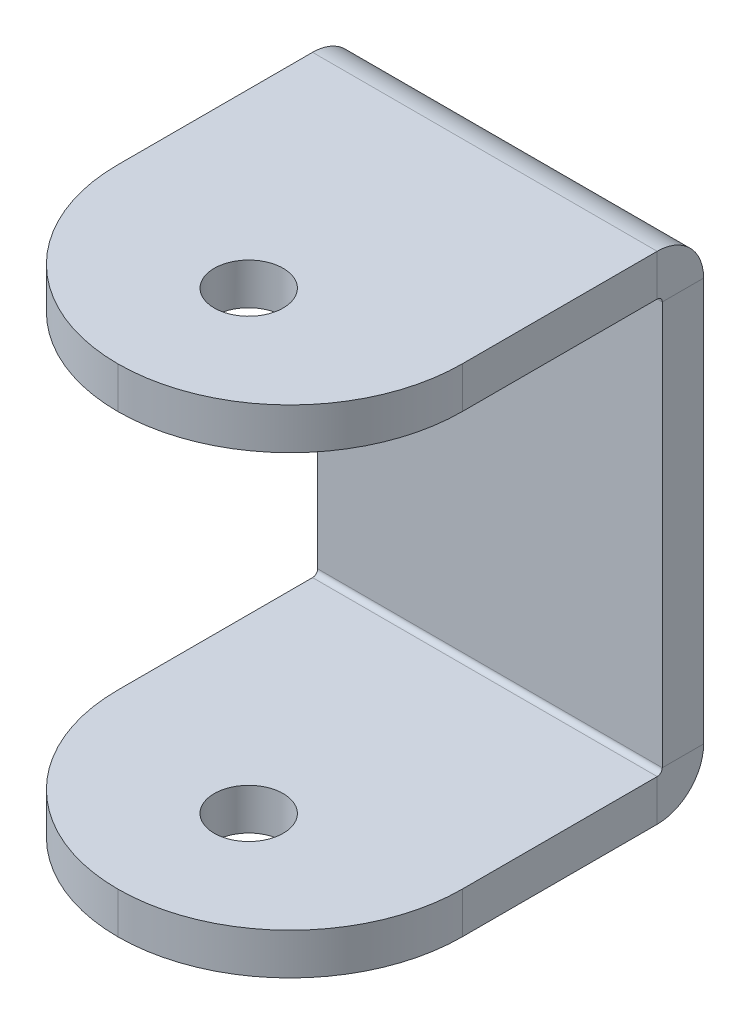
ISO-10303-21;
HEADER;
FILE_DESCRIPTION(('STEP AP214'),'2;1');
FILE_NAME('part.step','',(''),(''),'','','');
FILE_SCHEMA(('AUTOMOTIVE_DESIGN { 1 0 10303 214 1 1 1 1 }'));
ENDSEC;
DATA;
#1=APPLICATION_CONTEXT('core data for automotive mechanical design processes');
#2=APPLICATION_PROTOCOL_DEFINITION('international standard','automotive_design',2000,#1);
#3=PRODUCT_CONTEXT('',#1,'mechanical');
#4=PRODUCT('Part','Part','',(#3));
#5=PRODUCT_RELATED_PRODUCT_CATEGORY('part','',(#4));
#6=PRODUCT_DEFINITION_FORMATION('','',#4);
#7=PRODUCT_DEFINITION_CONTEXT('part definition',#1,'design');
#8=PRODUCT_DEFINITION('design','',#6,#7);
#9=PRODUCT_DEFINITION_SHAPE('','',#8);
#10=(LENGTH_UNIT() NAMED_UNIT(*) SI_UNIT(.MILLI.,.METRE.));
#11=(NAMED_UNIT(*) PLANE_ANGLE_UNIT() SI_UNIT($,.RADIAN.));
#12=(NAMED_UNIT(*) SI_UNIT($,.STERADIAN.) SOLID_ANGLE_UNIT());
#13=UNCERTAINTY_MEASURE_WITH_UNIT(LENGTH_MEASURE(1.E-05),#10,'distance_accuracy_value','');
#14=(GEOMETRIC_REPRESENTATION_CONTEXT(3) GLOBAL_UNCERTAINTY_ASSIGNED_CONTEXT((#13)) GLOBAL_UNIT_ASSIGNED_CONTEXT((#10,
#11,#12)) REPRESENTATION_CONTEXT('',''));
#15=CARTESIAN_POINT('',(0.,0.,0.));
#16=DIRECTION('',(0.,0.,1.));
#17=DIRECTION('',(1.,0.,0.));
#18=AXIS2_PLACEMENT_3D('',#15,#16,#17);
#19=CARTESIAN_POINT('',(-25.,-30.,-6.));
#20=DIRECTION('',(0.,0.,1.));
#21=DIRECTION('',(1.,0.,0.));
#22=AXIS2_PLACEMENT_3D('',#19,#20,#21);
#23=PLANE('',#22);
#24=DIRECTION('',(1.,0.,0.));
#25=VECTOR('',#24,1.);
#26=CARTESIAN_POINT('',(25.,-29.2634,-6.));
#27=LINE('',#26,#25);
#28=CARTESIAN_POINT('',(25.,-29.2634,-6.));
#29=VERTEX_POINT('',#28);
#30=CARTESIAN_POINT('',(-25.,-29.2634,-6.));
#31=VERTEX_POINT('',#30);
#32=EDGE_CURVE('E143',#29,#31,#27,.F.);
#33=ORIENTED_EDGE('',*,*,#32,.T.);
#34=DIRECTION('',(0.,-1.,0.));
#35=VECTOR('',#34,1.);
#36=CARTESIAN_POINT('',(-25.,30.,-6.));
#37=LINE('',#36,#35);
#38=CARTESIAN_POINT('',(-25.,29.2634,-5.99999999999999));
#39=VERTEX_POINT('',#38);
#40=EDGE_CURVE('E237',#39,#31,#37,.T.);
#41=ORIENTED_EDGE('',*,*,#40,.F.);
#42=DIRECTION('',(-1.,0.,0.));
#43=VECTOR('',#42,1.);
#44=CARTESIAN_POINT('',(-25.,29.2634,-5.99999999999999));
#45=LINE('',#44,#43);
#46=CARTESIAN_POINT('',(25.,29.2634,-6.));
#47=VERTEX_POINT('',#46);
#48=EDGE_CURVE('E213',#39,#47,#45,.F.);
#49=ORIENTED_EDGE('',*,*,#48,.T.);
#50=DIRECTION('',(0.,1.,0.));
#51=VECTOR('',#50,1.);
#52=CARTESIAN_POINT('',(25.,30.,-6.));
#53=LINE('',#52,#51);
#54=EDGE_CURVE('E240',#29,#47,#53,.T.);
#55=ORIENTED_EDGE('',*,*,#54,.F.);
#56=EDGE_LOOP('',(#33,#41,#49,#55));
#57=FACE_BOUND('',#56,.T.);
#58=ADVANCED_FACE('F32',(#57),#23,.F.);
#59=CARTESIAN_POINT('',(-25.,-30.,0.));
#60=DIRECTION('',(0.,0.,1.));
#61=DIRECTION('',(1.,0.,0.));
#62=AXIS2_PLACEMENT_3D('',#59,#60,#61);
#63=PLANE('',#62);
#64=DIRECTION('',(0.,-1.,0.));
#65=VECTOR('',#64,1.);
#66=CARTESIAN_POINT('',(-25.,30.,0.));
#67=LINE('',#66,#65);
#68=CARTESIAN_POINT('',(-25.,29.2634,0.));
#69=VERTEX_POINT('',#68);
#70=CARTESIAN_POINT('',(-25.,-29.2634,0.));
#71=VERTEX_POINT('',#70);
#72=EDGE_CURVE('E234',#69,#71,#67,.T.);
#73=ORIENTED_EDGE('',*,*,#72,.T.);
#74=DIRECTION('',(1.,0.,0.));
#75=VECTOR('',#74,1.);
#76=CARTESIAN_POINT('',(25.,-29.2634,0.));
#77=LINE('',#76,#75);
#78=CARTESIAN_POINT('',(25.,-29.2634,0.));
#79=VERTEX_POINT('',#78);
#80=EDGE_CURVE('E173',#79,#71,#77,.F.);
#81=ORIENTED_EDGE('',*,*,#80,.F.);
#82=DIRECTION('',(0.,1.,0.));
#83=VECTOR('',#82,1.);
#84=CARTESIAN_POINT('',(25.,30.,0.));
#85=LINE('',#84,#83);
#86=CARTESIAN_POINT('',(25.,29.2634,0.));
#87=VERTEX_POINT('',#86);
#88=EDGE_CURVE('E241',#79,#87,#85,.T.);
#89=ORIENTED_EDGE('',*,*,#88,.T.);
#90=DIRECTION('',(-1.,0.,0.));
#91=VECTOR('',#90,1.);
#92=CARTESIAN_POINT('',(-25.,29.2634,0.));
#93=LINE('',#92,#91);
#94=EDGE_CURVE('E226',#69,#87,#93,.F.);
#95=ORIENTED_EDGE('',*,*,#94,.F.);
#96=EDGE_LOOP('',(#73,#81,#89,#95));
#97=FACE_BOUND('',#96,.T.);
#98=ADVANCED_FACE('F316',(#97),#63,.T.);
#99=CARTESIAN_POINT('',(25.,30.,-6.));
#100=DIRECTION('',(1.,0.,0.));
#101=DIRECTION('',(0.,1.,0.));
#102=AXIS2_PLACEMENT_3D('',#99,#100,#101);
#103=PLANE('',#102);
#104=ORIENTED_EDGE('',*,*,#88,.F.);
#105=DIRECTION('',(0.,0.,-1.));
#106=VECTOR('',#105,1.);
#107=CARTESIAN_POINT('',(25.,-29.2634,0.));
#108=LINE('',#107,#106);
#109=EDGE_CURVE('E182',#79,#29,#108,.T.);
#110=ORIENTED_EDGE('',*,*,#109,.T.);
#111=ORIENTED_EDGE('',*,*,#54,.T.);
#112=DIRECTION('',(0.,0.,-1.));
#113=VECTOR('',#112,1.);
#114=CARTESIAN_POINT('',(25.,29.2634,0.));
#115=LINE('',#114,#113);
#116=EDGE_CURVE('E231',#87,#47,#115,.T.);
#117=ORIENTED_EDGE('',*,*,#116,.F.);
#118=EDGE_LOOP('',(#104,#110,#111,#117));
#119=FACE_BOUND('',#118,.T.);
#120=ADVANCED_FACE('F322',(#119),#103,.T.);
#121=CARTESIAN_POINT('',(-25.,30.,-6.));
#122=DIRECTION('',(-1.,0.,0.));
#123=DIRECTION('',(0.,-1.,0.));
#124=AXIS2_PLACEMENT_3D('',#121,#122,#123);
#125=PLANE('',#124);
#126=DIRECTION('',(0.,0.,-1.));
#127=VECTOR('',#126,1.);
#128=CARTESIAN_POINT('',(-25.,-29.2634,0.));
#129=LINE('',#128,#127);
#130=EDGE_CURVE('E188',#71,#31,#129,.T.);
#131=ORIENTED_EDGE('',*,*,#130,.F.);
#132=ORIENTED_EDGE('',*,*,#72,.F.);
#133=DIRECTION('',(0.,0.,-1.));
#134=VECTOR('',#133,1.);
#135=CARTESIAN_POINT('',(-25.,29.2634,0.));
#136=LINE('',#135,#134);
#137=EDGE_CURVE('E220',#69,#39,#136,.T.);
#138=ORIENTED_EDGE('',*,*,#137,.T.);
#139=ORIENTED_EDGE('',*,*,#40,.T.);
#140=EDGE_LOOP('',(#131,#132,#138,#139));
#141=FACE_BOUND('',#140,.T.);
#142=ADVANCED_FACE('F331',(#141),#125,.T.);
#143=CARTESIAN_POINT('',(25.,29.2634,0.736599999999999));
#144=DIRECTION('',(1.,0.,0.));
#145=DIRECTION('',(0.,0.,-1.));
#146=AXIS2_PLACEMENT_3D('',#143,#144,#145);
#147=PLANE('',#146);
#148=DIRECTION('',(0.,1.,0.));
#149=VECTOR('',#148,1.);
#150=CARTESIAN_POINT('',(25.,30.,0.736599999999997));
#151=LINE('',#150,#149);
#152=CARTESIAN_POINT('',(25.,30.,0.736599999999997));
#153=VERTEX_POINT('',#152);
#154=CARTESIAN_POINT('',(25.,36.,0.736599999999975));
#155=VERTEX_POINT('',#154);
#156=EDGE_CURVE('E191',#153,#155,#151,.T.);
#157=ORIENTED_EDGE('',*,*,#156,.F.);
#158=CARTESIAN_POINT('',(25.,29.2634,0.736599999999999));
#159=DIRECTION('',(-1.,0.,0.));
#160=DIRECTION('',(0.,0.,1.));
#161=AXIS2_PLACEMENT_3D('',#158,#159,#160);
#162=CIRCLE('',#161,0.736599999999997);
#163=EDGE_CURVE('E223',#87,#153,#162,.F.);
#164=ORIENTED_EDGE('',*,*,#163,.F.);
#165=ORIENTED_EDGE('',*,*,#116,.T.);
#166=CARTESIAN_POINT('',(25.,29.2634,0.736599999999999));
#167=DIRECTION('',(-1.,0.,0.));
#168=DIRECTION('',(0.,0.,1.));
#169=AXIS2_PLACEMENT_3D('',#166,#167,#168);
#170=CIRCLE('',#169,6.7366);
#171=EDGE_CURVE('E216',#47,#155,#170,.F.);
#172=ORIENTED_EDGE('',*,*,#171,.T.);
#173=EDGE_LOOP('',(#157,#164,#165,#172));
#174=FACE_BOUND('',#173,.T.);
#175=ADVANCED_FACE('F334',(#174),#147,.T.);
#176=CARTESIAN_POINT('',(-25.,29.2634,0.736600000000007));
#177=DIRECTION('',(1.,0.,0.));
#178=DIRECTION('',(0.,0.,-1.));
#179=AXIS2_PLACEMENT_3D('',#176,#177,#178);
#180=PLANE('',#179);
#181=CARTESIAN_POINT('',(-25.,29.2634,0.736600000000007));
#182=DIRECTION('',(-1.,0.,0.));
#183=DIRECTION('',(0.,0.,1.));
#184=AXIS2_PLACEMENT_3D('',#181,#182,#183);
#185=CIRCLE('',#184,0.736599999999997);
#186=CARTESIAN_POINT('',(-25.,30.,0.736600000000004));
#187=VERTEX_POINT('',#186);
#188=EDGE_CURVE('E210',#187,#69,#185,.T.);
#189=ORIENTED_EDGE('',*,*,#188,.F.);
#190=DIRECTION('',(0.,1.,0.));
#191=VECTOR('',#190,1.);
#192=CARTESIAN_POINT('',(-25.,30.,0.736600000000004));
#193=LINE('',#192,#191);
#194=CARTESIAN_POINT('',(-25.,36.,0.736599999999983));
#195=VERTEX_POINT('',#194);
#196=EDGE_CURVE('E196',#187,#195,#193,.T.);
#197=ORIENTED_EDGE('',*,*,#196,.T.);
#198=CARTESIAN_POINT('',(-25.,29.2634,0.736600000000007));
#199=DIRECTION('',(-1.,0.,0.));
#200=DIRECTION('',(0.,0.,1.));
#201=AXIS2_PLACEMENT_3D('',#198,#199,#200);
#202=CIRCLE('',#201,6.7366);
#203=EDGE_CURVE('E217',#195,#39,#202,.T.);
#204=ORIENTED_EDGE('',*,*,#203,.T.);
#205=ORIENTED_EDGE('',*,*,#137,.F.);
#206=EDGE_LOOP('',(#189,#197,#204,#205));
#207=FACE_BOUND('',#206,.T.);
#208=ADVANCED_FACE('F326',(#207),#180,.F.);
#209=CARTESIAN_POINT('',(-25.,29.2634,0.736600000000007));
#210=DIRECTION('',(-1.,0.,0.));
#211=DIRECTION('',(0.,1.,0.));
#212=AXIS2_PLACEMENT_3D('',#209,#210,#211);
#213=CYLINDRICAL_SURFACE('',#212,6.7366);
#214=ORIENTED_EDGE('',*,*,#48,.F.);
#215=ORIENTED_EDGE('',*,*,#203,.F.);
#216=DIRECTION('',(1.,0.,0.));
#217=VECTOR('',#216,1.);
#218=CARTESIAN_POINT('',(-25.,36.,0.736599999999983));
#219=LINE('',#218,#217);
#220=EDGE_CURVE('E199',#195,#155,#219,.T.);
#221=ORIENTED_EDGE('',*,*,#220,.T.);
#222=ORIENTED_EDGE('',*,*,#171,.F.);
#223=EDGE_LOOP('',(#214,#215,#221,#222));
#224=FACE_BOUND('',#223,.T.);
#225=ADVANCED_FACE('F340',(#224),#213,.T.);
#226=CARTESIAN_POINT('',(-25.,29.2634,0.736600000000007));
#227=DIRECTION('',(-1.,0.,0.));
#228=DIRECTION('',(0.,1.,0.));
#229=AXIS2_PLACEMENT_3D('',#226,#227,#228);
#230=CYLINDRICAL_SURFACE('',#229,0.736599999999997);
#231=ORIENTED_EDGE('',*,*,#94,.T.);
#232=ORIENTED_EDGE('',*,*,#163,.T.);
#233=DIRECTION('',(-1.,0.,0.));
#234=VECTOR('',#233,1.);
#235=CARTESIAN_POINT('',(25.,30.,0.736599999999997));
#236=LINE('',#235,#234);
#237=EDGE_CURVE('E194',#153,#187,#236,.T.);
#238=ORIENTED_EDGE('',*,*,#237,.T.);
#239=ORIENTED_EDGE('',*,*,#188,.T.);
#240=EDGE_LOOP('',(#231,#232,#238,#239));
#241=FACE_BOUND('',#240,.T.);
#242=ADVANCED_FACE('F347',(#241),#230,.F.);
#243=CARTESIAN_POINT('',(-25.,36.0000000000002,54.));
#244=DIRECTION('',(1.,0.,0.));
#245=DIRECTION('',(0.,0.,-1.));
#246=AXIS2_PLACEMENT_3D('',#243,#244,#245);
#247=PLANE('',#246);
#248=DIRECTION('',(0.,0.,1.));
#249=VECTOR('',#248,1.);
#250=CARTESIAN_POINT('',(-25.,30.0000000000002,54.));
#251=LINE('',#250,#249);
#252=CARTESIAN_POINT('',(-25.,30.0000000000001,29.));
#253=VERTEX_POINT('',#252);
#254=EDGE_CURVE('E204',#187,#253,#251,.T.);
#255=ORIENTED_EDGE('',*,*,#254,.T.);
#256=DIRECTION('',(0.,-1.,0.));
#257=VECTOR('',#256,1.);
#258=CARTESIAN_POINT('',(-25.,36.0000000000001,29.));
#259=LINE('',#258,#257);
#260=CARTESIAN_POINT('',(-25.,36.0000000000001,29.));
#261=VERTEX_POINT('',#260);
#262=EDGE_CURVE('E11',#253,#261,#259,.F.);
#263=ORIENTED_EDGE('',*,*,#262,.T.);
#264=DIRECTION('',(0.,0.,1.));
#265=VECTOR('',#264,1.);
#266=CARTESIAN_POINT('',(-25.,36.0000000000002,54.));
#267=LINE('',#266,#265);
#268=EDGE_CURVE('E205',#195,#261,#267,.T.);
#269=ORIENTED_EDGE('',*,*,#268,.F.);
#270=ORIENTED_EDGE('',*,*,#196,.F.);
#271=EDGE_LOOP('',(#255,#263,#269,#270));
#272=FACE_BOUND('',#271,.T.);
#273=ADVANCED_FACE('F364',(#272),#247,.F.);
#274=CARTESIAN_POINT('',(25.,36.,0.));
#275=DIRECTION('',(-1.,0.,0.));
#276=DIRECTION('',(0.,-1.,0.));
#277=AXIS2_PLACEMENT_3D('',#274,#275,#276);
#278=PLANE('',#277);
#279=DIRECTION('',(0.,0.,-1.));
#280=VECTOR('',#279,1.);
#281=CARTESIAN_POINT('',(25.,36.,0.));
#282=LINE('',#281,#280);
#283=CARTESIAN_POINT('',(25.,36.0000000000001,29.));
#284=VERTEX_POINT('',#283);
#285=EDGE_CURVE('E207',#284,#155,#282,.T.);
#286=ORIENTED_EDGE('',*,*,#285,.F.);
#287=DIRECTION('',(0.,-1.,0.));
#288=VECTOR('',#287,1.);
#289=CARTESIAN_POINT('',(25.,36.0000000000001,29.));
#290=LINE('',#289,#288);
#291=CARTESIAN_POINT('',(25.,30.0000000000001,29.));
#292=VERTEX_POINT('',#291);
#293=EDGE_CURVE('E255',#284,#292,#290,.T.);
#294=ORIENTED_EDGE('',*,*,#293,.T.);
#295=DIRECTION('',(0.,0.,-1.));
#296=VECTOR('',#295,1.);
#297=CARTESIAN_POINT('',(25.,30.,0.));
#298=LINE('',#297,#296);
#299=EDGE_CURVE('E208',#292,#153,#298,.T.);
#300=ORIENTED_EDGE('',*,*,#299,.T.);
#301=ORIENTED_EDGE('',*,*,#156,.T.);
#302=EDGE_LOOP('',(#286,#294,#300,#301));
#303=FACE_BOUND('',#302,.T.);
#304=ADVANCED_FACE('F354',(#303),#278,.F.);
#305=CARTESIAN_POINT('',(-25.,36.,0.));
#306=DIRECTION('',(0.,-1.,0.));
#307=DIRECTION('',(0.,0.,-1.));
#308=AXIS2_PLACEMENT_3D('',#305,#306,#307);
#309=PLANE('',#308);
#310=CARTESIAN_POINT('',(0.,36.0000000000001,34.9999999999999));
#311=DIRECTION('',(0.,1.,0.));
#312=DIRECTION('',(0.,0.,1.));
#313=AXIS2_PLACEMENT_3D('',#310,#311,#312);
#314=CIRCLE('',#313,4.99999999999999);
#315=CARTESIAN_POINT('',(0.,36.0000000000001,39.9999999999999));
#316=VERTEX_POINT('',#315);
#317=EDGE_CURVE('E415',#316,#316,#314,.T.);
#318=ORIENTED_EDGE('',*,*,#317,.F.);
#319=EDGE_LOOP('',(#318));
#320=FACE_BOUND('',#319,.T.);
#321=CARTESIAN_POINT('',(0.,36.0000000000001,29.));
#322=DIRECTION('',(0.,-1.,0.));
#323=DIRECTION('',(0.,0.,-1.));
#324=AXIS2_PLACEMENT_3D('',#321,#322,#323);
#325=CIRCLE('',#324,25.);
#326=CARTESIAN_POINT('',(0.,36.0000000000002,54.));
#327=VERTEX_POINT('',#326);
#328=EDGE_CURVE('E49',#261,#327,#325,.F.);
#329=ORIENTED_EDGE('',*,*,#328,.T.);
#330=CARTESIAN_POINT('',(0.,36.0000000000001,29.));
#331=DIRECTION('',(0.,-1.,0.));
#332=DIRECTION('',(0.,0.,-1.));
#333=AXIS2_PLACEMENT_3D('',#330,#331,#332);
#334=CIRCLE('',#333,25.);
#335=EDGE_CURVE('E263',#327,#284,#334,.F.);
#336=ORIENTED_EDGE('',*,*,#335,.T.);
#337=ORIENTED_EDGE('',*,*,#285,.T.);
#338=ORIENTED_EDGE('',*,*,#220,.F.);
#339=ORIENTED_EDGE('',*,*,#268,.T.);
#340=EDGE_LOOP('',(#329,#336,#337,#338,#339));
#341=FACE_BOUND('',#340,.T.);
#342=ADVANCED_FACE('F365',(#320,#341),#309,.F.);
#343=CARTESIAN_POINT('',(-25.,30.,0.));
#344=DIRECTION('',(0.,-1.,0.));
#345=DIRECTION('',(0.,0.,-1.));
#346=AXIS2_PLACEMENT_3D('',#343,#344,#345);
#347=PLANE('',#346);
#348=CARTESIAN_POINT('',(0.,30.0000000000001,34.9999999999999));
#349=DIRECTION('',(0.,-1.,0.));
#350=DIRECTION('',(0.,0.,-1.));
#351=AXIS2_PLACEMENT_3D('',#348,#349,#350);
#352=CIRCLE('',#351,4.99999999999999);
#353=CARTESIAN_POINT('',(0.,30.0000000000001,29.9999999999999));
#354=VERTEX_POINT('',#353);
#355=EDGE_CURVE('E271',#354,#354,#352,.T.);
#356=ORIENTED_EDGE('',*,*,#355,.F.);
#357=EDGE_LOOP('',(#356));
#358=FACE_BOUND('',#357,.T.);
#359=ORIENTED_EDGE('',*,*,#299,.F.);
#360=CARTESIAN_POINT('',(0.,30.0000000000001,29.));
#361=DIRECTION('',(0.,-1.,0.));
#362=DIRECTION('',(0.,0.,-1.));
#363=AXIS2_PLACEMENT_3D('',#360,#361,#362);
#364=CIRCLE('',#363,25.);
#365=CARTESIAN_POINT('',(0.,30.0000000000002,54.));
#366=VERTEX_POINT('',#365);
#367=EDGE_CURVE('E260',#292,#366,#364,.T.);
#368=ORIENTED_EDGE('',*,*,#367,.T.);
#369=CARTESIAN_POINT('',(0.,30.0000000000001,29.));
#370=DIRECTION('',(0.,-1.,0.));
#371=DIRECTION('',(0.,0.,-1.));
#372=AXIS2_PLACEMENT_3D('',#369,#370,#371);
#373=CIRCLE('',#372,25.);
#374=EDGE_CURVE('E258',#366,#253,#373,.T.);
#375=ORIENTED_EDGE('',*,*,#374,.T.);
#376=ORIENTED_EDGE('',*,*,#254,.F.);
#377=ORIENTED_EDGE('',*,*,#237,.F.);
#378=EDGE_LOOP('',(#359,#368,#375,#376,#377));
#379=FACE_BOUND('',#378,.T.);
#380=ADVANCED_FACE('F358',(#358,#379),#347,.T.);
#381=CARTESIAN_POINT('',(-25.,-29.2634,0.736599999999999));
#382=DIRECTION('',(-1.,0.,0.));
#383=DIRECTION('',(0.,0.,1.));
#384=AXIS2_PLACEMENT_3D('',#381,#382,#383);
#385=PLANE('',#384);
#386=DIRECTION('',(0.,-1.,0.));
#387=VECTOR('',#386,1.);
#388=CARTESIAN_POINT('',(-25.,-30.,0.736599999999997));
#389=LINE('',#388,#387);
#390=CARTESIAN_POINT('',(-25.,-30.,0.736599999999997));
#391=VERTEX_POINT('',#390);
#392=CARTESIAN_POINT('',(-25.,-36.,0.736599999999975));
#393=VERTEX_POINT('',#392);
#394=EDGE_CURVE('E268',#391,#393,#389,.T.);
#395=ORIENTED_EDGE('',*,*,#394,.F.);
#396=CARTESIAN_POINT('',(-25.,-29.2634,0.736599999999999));
#397=DIRECTION('',(1.,0.,0.));
#398=DIRECTION('',(0.,0.,-1.));
#399=AXIS2_PLACEMENT_3D('',#396,#397,#398);
#400=CIRCLE('',#399,0.7366);
#401=EDGE_CURVE('E146',#71,#391,#400,.F.);
#402=ORIENTED_EDGE('',*,*,#401,.F.);
#403=ORIENTED_EDGE('',*,*,#130,.T.);
#404=CARTESIAN_POINT('',(-25.,-29.2634,0.736599999999999));
#405=DIRECTION('',(1.,0.,0.));
#406=DIRECTION('',(0.,0.,-1.));
#407=AXIS2_PLACEMENT_3D('',#404,#405,#406);
#408=CIRCLE('',#407,6.7366);
#409=EDGE_CURVE('E181',#31,#393,#408,.F.);
#410=ORIENTED_EDGE('',*,*,#409,.T.);
#411=EDGE_LOOP('',(#395,#402,#403,#410));
#412=FACE_BOUND('',#411,.T.);
#413=ADVANCED_FACE('F292',(#412),#385,.T.);
#414=CARTESIAN_POINT('',(25.,-29.2634,0.736600000000003));
#415=DIRECTION('',(-1.,0.,0.));
#416=DIRECTION('',(0.,0.,1.));
#417=AXIS2_PLACEMENT_3D('',#414,#415,#416);
#418=PLANE('',#417);
#419=CARTESIAN_POINT('',(25.,-29.2634,0.736600000000003));
#420=DIRECTION('',(1.,0.,0.));
#421=DIRECTION('',(0.,0.,-1.));
#422=AXIS2_PLACEMENT_3D('',#419,#420,#421);
#423=CIRCLE('',#422,0.7366);
#424=CARTESIAN_POINT('',(25.,-30.,0.7366));
#425=VERTEX_POINT('',#424);
#426=EDGE_CURVE('E153',#425,#79,#423,.T.);
#427=ORIENTED_EDGE('',*,*,#426,.F.);
#428=DIRECTION('',(0.,-1.,0.));
#429=VECTOR('',#428,1.);
#430=CARTESIAN_POINT('',(25.,-30.,0.7366));
#431=LINE('',#430,#429);
#432=CARTESIAN_POINT('',(25.,-36.,0.736599999999979));
#433=VERTEX_POINT('',#432);
#434=EDGE_CURVE('E150',#425,#433,#431,.T.);
#435=ORIENTED_EDGE('',*,*,#434,.T.);
#436=CARTESIAN_POINT('',(25.,-29.2634,0.736600000000003));
#437=DIRECTION('',(1.,0.,0.));
#438=DIRECTION('',(0.,0.,-1.));
#439=AXIS2_PLACEMENT_3D('',#436,#437,#438);
#440=CIRCLE('',#439,6.7366);
#441=EDGE_CURVE('E136',#433,#29,#440,.T.);
#442=ORIENTED_EDGE('',*,*,#441,.T.);
#443=ORIENTED_EDGE('',*,*,#109,.F.);
#444=EDGE_LOOP('',(#427,#435,#442,#443));
#445=FACE_BOUND('',#444,.T.);
#446=ADVANCED_FACE('F151',(#445),#418,.F.);
#447=CARTESIAN_POINT('',(25.,-29.2634,0.736600000000003));
#448=DIRECTION('',(1.,0.,0.));
#449=DIRECTION('',(0.,-1.,0.));
#450=AXIS2_PLACEMENT_3D('',#447,#448,#449);
#451=CYLINDRICAL_SURFACE('',#450,6.7366);
#452=ORIENTED_EDGE('',*,*,#32,.F.);
#453=ORIENTED_EDGE('',*,*,#441,.F.);
#454=DIRECTION('',(-1.,0.,0.));
#455=VECTOR('',#454,1.);
#456=CARTESIAN_POINT('',(-25.,-36.,0.736599999999976));
#457=LINE('',#456,#455);
#458=EDGE_CURVE('E141',#433,#393,#457,.T.);
#459=ORIENTED_EDGE('',*,*,#458,.T.);
#460=ORIENTED_EDGE('',*,*,#409,.F.);
#461=EDGE_LOOP('',(#452,#453,#459,#460));
#462=FACE_BOUND('',#461,.T.);
#463=ADVANCED_FACE('F138',(#462),#451,.T.);
#464=CARTESIAN_POINT('',(25.,-29.2634,0.736600000000003));
#465=DIRECTION('',(1.,0.,0.));
#466=DIRECTION('',(0.,-1.,0.));
#467=AXIS2_PLACEMENT_3D('',#464,#465,#466);
#468=CYLINDRICAL_SURFACE('',#467,0.7366);
#469=ORIENTED_EDGE('',*,*,#80,.T.);
#470=ORIENTED_EDGE('',*,*,#401,.T.);
#471=DIRECTION('',(1.,0.,0.));
#472=VECTOR('',#471,1.);
#473=CARTESIAN_POINT('',(-25.,-30.,0.736599999999997));
#474=LINE('',#473,#472);
#475=EDGE_CURVE('E158',#391,#425,#474,.T.);
#476=ORIENTED_EDGE('',*,*,#475,.T.);
#477=ORIENTED_EDGE('',*,*,#426,.T.);
#478=EDGE_LOOP('',(#469,#470,#476,#477));
#479=FACE_BOUND('',#478,.T.);
#480=ADVANCED_FACE('F295',(#479),#468,.F.);
#481=CARTESIAN_POINT('',(-25.,-36.,0.));
#482=DIRECTION('',(1.,0.,0.));
#483=DIRECTION('',(0.,0.,-1.));
#484=AXIS2_PLACEMENT_3D('',#481,#482,#483);
#485=PLANE('',#484);
#486=DIRECTION('',(0.,0.,-1.));
#487=VECTOR('',#486,1.);
#488=CARTESIAN_POINT('',(-25.,-36.,0.));
#489=LINE('',#488,#487);
#490=CARTESIAN_POINT('',(-25.,-36.0000000000001,29.));
#491=VERTEX_POINT('',#490);
#492=EDGE_CURVE('E165',#491,#393,#489,.T.);
#493=ORIENTED_EDGE('',*,*,#492,.F.);
#494=DIRECTION('',(0.,1.,0.));
#495=VECTOR('',#494,1.);
#496=CARTESIAN_POINT('',(-25.,-36.0000000000001,29.));
#497=LINE('',#496,#495);
#498=CARTESIAN_POINT('',(-25.,-30.0000000000001,29.));
#499=VERTEX_POINT('',#498);
#500=EDGE_CURVE('E41',#491,#499,#497,.T.);
#501=ORIENTED_EDGE('',*,*,#500,.T.);
#502=DIRECTION('',(0.,0.,-1.));
#503=VECTOR('',#502,1.);
#504=CARTESIAN_POINT('',(-25.,-30.,0.));
#505=LINE('',#504,#503);
#506=EDGE_CURVE('E166',#499,#391,#505,.T.);
#507=ORIENTED_EDGE('',*,*,#506,.T.);
#508=ORIENTED_EDGE('',*,*,#394,.T.);
#509=EDGE_LOOP('',(#493,#501,#507,#508));
#510=FACE_BOUND('',#509,.T.);
#511=ADVANCED_FACE('F287',(#510),#485,.F.);
#512=CARTESIAN_POINT('',(25.,-36.0000000000002,54.));
#513=DIRECTION('',(-1.,0.,0.));
#514=DIRECTION('',(0.,0.,1.));
#515=AXIS2_PLACEMENT_3D('',#512,#513,#514);
#516=PLANE('',#515);
#517=DIRECTION('',(0.,0.,1.));
#518=VECTOR('',#517,1.);
#519=CARTESIAN_POINT('',(25.,-30.0000000000002,54.));
#520=LINE('',#519,#518);
#521=CARTESIAN_POINT('',(25.,-30.0000000000001,29.));
#522=VERTEX_POINT('',#521);
#523=EDGE_CURVE('E175',#425,#522,#520,.T.);
#524=ORIENTED_EDGE('',*,*,#523,.T.);
#525=DIRECTION('',(0.,1.,0.));
#526=VECTOR('',#525,1.);
#527=CARTESIAN_POINT('',(25.,-36.0000000000001,29.));
#528=LINE('',#527,#526);
#529=CARTESIAN_POINT('',(25.,-36.0000000000001,29.));
#530=VERTEX_POINT('',#529);
#531=EDGE_CURVE('E171',#522,#530,#528,.F.);
#532=ORIENTED_EDGE('',*,*,#531,.T.);
#533=DIRECTION('',(0.,0.,1.));
#534=VECTOR('',#533,1.);
#535=CARTESIAN_POINT('',(25.,-36.0000000000002,54.));
#536=LINE('',#535,#534);
#537=EDGE_CURVE('E163',#433,#530,#536,.T.);
#538=ORIENTED_EDGE('',*,*,#537,.F.);
#539=ORIENTED_EDGE('',*,*,#434,.F.);
#540=EDGE_LOOP('',(#524,#532,#538,#539));
#541=FACE_BOUND('',#540,.T.);
#542=ADVANCED_FACE('F169',(#541),#516,.F.);
#543=CARTESIAN_POINT('',(-25.,-36.0000000000002,54.));
#544=DIRECTION('',(0.,1.,0.));
#545=DIRECTION('',(0.,0.,1.));
#546=AXIS2_PLACEMENT_3D('',#543,#544,#545);
#547=PLANE('',#546);
#548=CARTESIAN_POINT('',(0.,-36.0000000000003,35.0000000000001));
#549=DIRECTION('',(0.,1.,0.));
#550=DIRECTION('',(0.,0.,1.));
#551=AXIS2_PLACEMENT_3D('',#548,#549,#550);
#552=CIRCLE('',#551,4.99999999999999);
#553=CARTESIAN_POINT('',(0.,-36.0000000000002,40.0000000000001));
#554=VERTEX_POINT('',#553);
#555=EDGE_CURVE('E279',#554,#554,#552,.T.);
#556=ORIENTED_EDGE('',*,*,#555,.T.);
#557=EDGE_LOOP('',(#556));
#558=FACE_BOUND('',#557,.T.);
#559=ORIENTED_EDGE('',*,*,#537,.T.);
#560=CARTESIAN_POINT('',(0.,-36.0000000000001,29.));
#561=DIRECTION('',(0.,1.,0.));
#562=DIRECTION('',(0.,0.,1.));
#563=AXIS2_PLACEMENT_3D('',#560,#561,#562);
#564=CIRCLE('',#563,25.);
#565=CARTESIAN_POINT('',(0.,-36.0000000000002,54.));
#566=VERTEX_POINT('',#565);
#567=EDGE_CURVE('E253',#530,#566,#564,.F.);
#568=ORIENTED_EDGE('',*,*,#567,.T.);
#569=CARTESIAN_POINT('',(0.,-36.0000000000001,29.));
#570=DIRECTION('',(0.,1.,0.));
#571=DIRECTION('',(0.,0.,1.));
#572=AXIS2_PLACEMENT_3D('',#569,#570,#571);
#573=CIRCLE('',#572,25.);
#574=EDGE_CURVE('E251',#566,#491,#573,.F.);
#575=ORIENTED_EDGE('',*,*,#574,.T.);
#576=ORIENTED_EDGE('',*,*,#492,.T.);
#577=ORIENTED_EDGE('',*,*,#458,.F.);
#578=EDGE_LOOP('',(#559,#568,#575,#576,#577));
#579=FACE_BOUND('',#578,.T.);
#580=ADVANCED_FACE('F162',(#558,#579),#547,.F.);
#581=CARTESIAN_POINT('',(-25.,-30.0000000000002,54.));
#582=DIRECTION('',(0.,1.,0.));
#583=DIRECTION('',(0.,0.,1.));
#584=AXIS2_PLACEMENT_3D('',#581,#582,#583);
#585=PLANE('',#584);
#586=CARTESIAN_POINT('',(0.,-30.0000000000001,35.0000000000001));
#587=DIRECTION('',(0.,1.,0.));
#588=DIRECTION('',(0.,0.,1.));
#589=AXIS2_PLACEMENT_3D('',#586,#587,#588);
#590=CIRCLE('',#589,4.99999999999999);
#591=CARTESIAN_POINT('',(0.,-30.0000000000001,40.0000000000001));
#592=VERTEX_POINT('',#591);
#593=EDGE_CURVE('E36',#592,#592,#590,.T.);
#594=ORIENTED_EDGE('',*,*,#593,.F.);
#595=EDGE_LOOP('',(#594));
#596=FACE_BOUND('',#595,.T.);
#597=CARTESIAN_POINT('',(0.,-30.0000000000001,29.));
#598=DIRECTION('',(0.,1.,0.));
#599=DIRECTION('',(0.,0.,1.));
#600=AXIS2_PLACEMENT_3D('',#597,#598,#599);
#601=CIRCLE('',#600,25.);
#602=CARTESIAN_POINT('',(0.,-30.0000000000002,54.));
#603=VERTEX_POINT('',#602);
#604=EDGE_CURVE('E243',#499,#603,#601,.T.);
#605=ORIENTED_EDGE('',*,*,#604,.T.);
#606=CARTESIAN_POINT('',(0.,-30.0000000000001,29.));
#607=DIRECTION('',(0.,1.,0.));
#608=DIRECTION('',(0.,0.,1.));
#609=AXIS2_PLACEMENT_3D('',#606,#607,#608);
#610=CIRCLE('',#609,25.);
#611=EDGE_CURVE('E248',#603,#522,#610,.T.);
#612=ORIENTED_EDGE('',*,*,#611,.T.);
#613=ORIENTED_EDGE('',*,*,#523,.F.);
#614=ORIENTED_EDGE('',*,*,#475,.F.);
#615=ORIENTED_EDGE('',*,*,#506,.F.);
#616=EDGE_LOOP('',(#605,#612,#613,#614,#615));
#617=FACE_BOUND('',#616,.T.);
#618=ADVANCED_FACE('F297',(#596,#617),#585,.T.);
#619=CARTESIAN_POINT('',(0.,-36.0000000000001,29.));
#620=DIRECTION('',(0.,1.,0.));
#621=DIRECTION('',(0.,0.,1.));
#622=AXIS2_PLACEMENT_3D('',#619,#620,#621);
#623=CYLINDRICAL_SURFACE('',#622,25.);
#624=ORIENTED_EDGE('',*,*,#500,.F.);
#625=ORIENTED_EDGE('',*,*,#574,.F.);
#626=DIRECTION('',(0.,1.,0.));
#627=VECTOR('',#626,1.);
#628=CARTESIAN_POINT('',(0.,-36.0000000000002,54.));
#629=LINE('',#628,#627);
#630=EDGE_CURVE('E266',#603,#566,#629,.F.);
#631=ORIENTED_EDGE('',*,*,#630,.F.);
#632=ORIENTED_EDGE('',*,*,#604,.F.);
#633=EDGE_LOOP('',(#624,#625,#631,#632));
#634=FACE_BOUND('',#633,.T.);
#635=ADVANCED_FACE('F305',(#634),#623,.T.);
#636=CARTESIAN_POINT('',(0.,-36.0000000000001,29.));
#637=DIRECTION('',(0.,1.,0.));
#638=DIRECTION('',(0.,0.,1.));
#639=AXIS2_PLACEMENT_3D('',#636,#637,#638);
#640=CYLINDRICAL_SURFACE('',#639,25.);
#641=ORIENTED_EDGE('',*,*,#567,.F.);
#642=ORIENTED_EDGE('',*,*,#531,.F.);
#643=ORIENTED_EDGE('',*,*,#611,.F.);
#644=ORIENTED_EDGE('',*,*,#630,.T.);
#645=EDGE_LOOP('',(#641,#642,#643,#644));
#646=FACE_BOUND('',#645,.T.);
#647=ADVANCED_FACE('F301',(#646),#640,.T.);
#648=CARTESIAN_POINT('',(0.,36.0000000000001,29.));
#649=DIRECTION('',(0.,-1.,0.));
#650=DIRECTION('',(0.,0.,-1.));
#651=AXIS2_PLACEMENT_3D('',#648,#649,#650);
#652=CYLINDRICAL_SURFACE('',#651,25.);
#653=DIRECTION('',(0.,-1.,0.));
#654=VECTOR('',#653,1.);
#655=CARTESIAN_POINT('',(0.,36.0000000000002,54.));
#656=LINE('',#655,#654);
#657=EDGE_CURVE('E269',#327,#366,#656,.T.);
#658=ORIENTED_EDGE('',*,*,#657,.F.);
#659=ORIENTED_EDGE('',*,*,#328,.F.);
#660=ORIENTED_EDGE('',*,*,#262,.F.);
#661=ORIENTED_EDGE('',*,*,#374,.F.);
#662=EDGE_LOOP('',(#658,#659,#660,#661));
#663=FACE_BOUND('',#662,.T.);
#664=ADVANCED_FACE('F34',(#663),#652,.T.);
#665=CARTESIAN_POINT('',(0.,36.0000000000001,29.));
#666=DIRECTION('',(0.,-1.,0.));
#667=DIRECTION('',(0.,0.,-1.));
#668=AXIS2_PLACEMENT_3D('',#665,#666,#667);
#669=CYLINDRICAL_SURFACE('',#668,25.);
#670=ORIENTED_EDGE('',*,*,#335,.F.);
#671=ORIENTED_EDGE('',*,*,#657,.T.);
#672=ORIENTED_EDGE('',*,*,#367,.F.);
#673=ORIENTED_EDGE('',*,*,#293,.F.);
#674=EDGE_LOOP('',(#670,#671,#672,#673));
#675=FACE_BOUND('',#674,.T.);
#676=ADVANCED_FACE('F367',(#675),#669,.T.);
#677=CARTESIAN_POINT('',(0.,36.0000000000001,34.9999999999999));
#678=DIRECTION('',(0.,1.,0.));
#679=DIRECTION('',(0.,0.,1.));
#680=AXIS2_PLACEMENT_3D('',#677,#678,#679);
#681=CYLINDRICAL_SURFACE('',#680,4.99999999999999);
#682=ORIENTED_EDGE('',*,*,#593,.T.);
#683=EDGE_LOOP('',(#682));
#684=FACE_BOUND('',#683,.T.);
#685=ORIENTED_EDGE('',*,*,#555,.F.);
#686=EDGE_LOOP('',(#685));
#687=FACE_BOUND('',#686,.T.);
#688=ADVANCED_FACE('F403',(#684,#687),#681,.F.);
#689=ORIENTED_EDGE('',*,*,#355,.T.);
#690=EDGE_LOOP('',(#689));
#691=FACE_BOUND('',#690,.T.);
#692=ORIENTED_EDGE('',*,*,#317,.T.);
#693=EDGE_LOOP('',(#692));
#694=FACE_BOUND('',#693,.T.);
#695=ADVANCED_FACE('F405',(#691,#694),#681,.F.);
#696=CLOSED_SHELL('',(#58,#98,#120,#142,#175,#208,#225,#242,#273,#304,#342,#380,#413,#446,#463,
#480,#511,#542,#580,#618,#635,#647,#664,#676,#688,#695));
#697=MANIFOLD_SOLID_BREP('B2',#696);
#698=ADVANCED_BREP_SHAPE_REPRESENTATION('',(#18,#697),#14);
#699=SHAPE_DEFINITION_REPRESENTATION(#9,#698);
ENDSEC;
END-ISO-10303-21;
